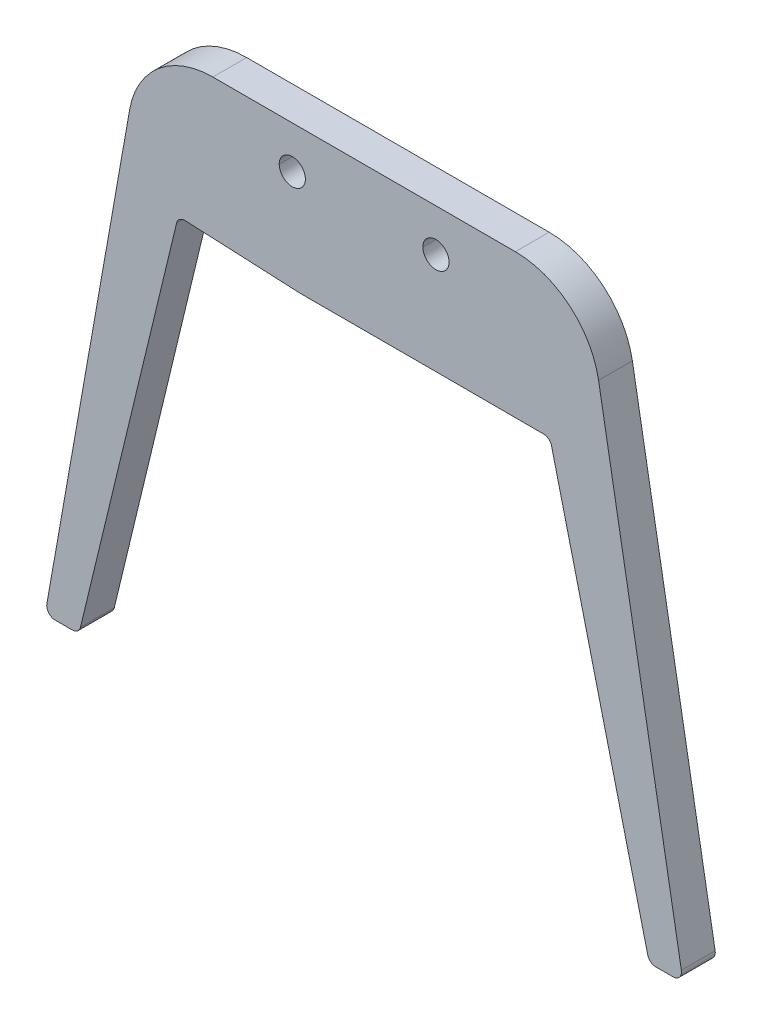
ISO-10303-21;
HEADER;
FILE_DESCRIPTION(('STEP AP214'),'2;1');
FILE_NAME('part.step','',(''),(''),'','','');
FILE_SCHEMA(('AUTOMOTIVE_DESIGN { 1 0 10303 214 1 1 1 1 }'));
ENDSEC;
DATA;
#1=APPLICATION_CONTEXT('core data for automotive mechanical design processes');
#2=APPLICATION_PROTOCOL_DEFINITION('international standard','automotive_design',2000,#1);
#3=PRODUCT_CONTEXT('',#1,'mechanical');
#4=PRODUCT('Part','Part','',(#3));
#5=PRODUCT_RELATED_PRODUCT_CATEGORY('part','',(#4));
#6=PRODUCT_DEFINITION_FORMATION('','',#4);
#7=PRODUCT_DEFINITION_CONTEXT('part definition',#1,'design');
#8=PRODUCT_DEFINITION('design','',#6,#7);
#9=PRODUCT_DEFINITION_SHAPE('','',#8);
#10=(LENGTH_UNIT() NAMED_UNIT(*) SI_UNIT(.MILLI.,.METRE.));
#11=(NAMED_UNIT(*) PLANE_ANGLE_UNIT() SI_UNIT($,.RADIAN.));
#12=(NAMED_UNIT(*) SI_UNIT($,.STERADIAN.) SOLID_ANGLE_UNIT());
#13=UNCERTAINTY_MEASURE_WITH_UNIT(LENGTH_MEASURE(1.E-05),#10,'distance_accuracy_value','');
#14=(GEOMETRIC_REPRESENTATION_CONTEXT(3) GLOBAL_UNCERTAINTY_ASSIGNED_CONTEXT((#13)) GLOBAL_UNIT_ASSIGNED_CONTEXT((#10,
#11,#12)) REPRESENTATION_CONTEXT('',''));
#15=CARTESIAN_POINT('',(0.,0.,0.));
#16=DIRECTION('',(0.,0.,1.));
#17=DIRECTION('',(1.,0.,0.));
#18=AXIS2_PLACEMENT_3D('',#15,#16,#17);
#19=CARTESIAN_POINT('',(-36.5641922306219,-60.,4.));
#20=DIRECTION('',(0.,0.,-1.));
#21=DIRECTION('',(-1.,0.,0.));
#22=AXIS2_PLACEMENT_3D('',#19,#20,#21);
#23=CYLINDRICAL_SURFACE('',#22,1.);
#24=DIRECTION('',(0.,0.,-1.));
#25=VECTOR('',#24,1.);
#26=CARTESIAN_POINT('',(-37.5641922306219,-60.,4.));
#27=LINE('',#26,#25);
#28=CARTESIAN_POINT('',(-37.5641922306219,-60.,4.));
#29=VERTEX_POINT('',#28);
#30=CARTESIAN_POINT('',(-37.5641922306219,-60.,0.));
#31=VERTEX_POINT('',#30);
#32=EDGE_CURVE('E250',#29,#31,#27,.T.);
#33=ORIENTED_EDGE('',*,*,#32,.F.);
#34=CARTESIAN_POINT('',(-36.5641922306219,-60.,4.));
#35=DIRECTION('',(0.,0.,1.));
#36=DIRECTION('',(1.,0.,0.));
#37=AXIS2_PLACEMENT_3D('',#34,#35,#36);
#38=CIRCLE('',#37,1.);
#39=CARTESIAN_POINT('',(-37.5489999836341,-59.8263518223331,4.));
#40=VERTEX_POINT('',#39);
#41=EDGE_CURVE('E233',#40,#29,#38,.T.);
#42=ORIENTED_EDGE('',*,*,#41,.F.);
#43=DIRECTION('',(0.,0.,1.));
#44=VECTOR('',#43,1.);
#45=CARTESIAN_POINT('',(-37.5489999836341,-59.8263518223331,4.));
#46=LINE('',#45,#44);
#47=CARTESIAN_POINT('',(-37.5489999836341,-59.8263518223331,0.));
#48=VERTEX_POINT('',#47);
#49=EDGE_CURVE('E343',#48,#40,#46,.T.);
#50=ORIENTED_EDGE('',*,*,#49,.F.);
#51=CARTESIAN_POINT('',(-36.5641922306219,-60.,0.));
#52=DIRECTION('',(0.,0.,-1.));
#53=DIRECTION('',(1.,0.,0.));
#54=AXIS2_PLACEMENT_3D('',#51,#52,#53);
#55=CIRCLE('',#54,1.);
#56=EDGE_CURVE('E251',#31,#48,#55,.T.);
#57=ORIENTED_EDGE('',*,*,#56,.F.);
#58=EDGE_LOOP('',(#33,#42,#50,#57));
#59=FACE_BOUND('',#58,.T.);
#60=ADVANCED_FACE('F15',(#59),#23,.T.);
#61=CARTESIAN_POINT('',(36.5641922306219,-60.,4.));
#62=DIRECTION('',(0.,0.,-1.));
#63=DIRECTION('',(-1.,0.,0.));
#64=AXIS2_PLACEMENT_3D('',#61,#62,#63);
#65=CYLINDRICAL_SURFACE('',#64,1.);
#66=CARTESIAN_POINT('',(36.5641922306219,-60.,4.));
#67=DIRECTION('',(0.,0.,1.));
#68=DIRECTION('',(1.,0.,0.));
#69=AXIS2_PLACEMENT_3D('',#66,#67,#68);
#70=CIRCLE('',#69,1.);
#71=CARTESIAN_POINT('',(36.5641922306219,-61.,4.));
#72=VERTEX_POINT('',#71);
#73=CARTESIAN_POINT('',(37.5489999836341,-59.8263518223331,4.));
#74=VERTEX_POINT('',#73);
#75=EDGE_CURVE('E311',#72,#74,#70,.T.);
#76=ORIENTED_EDGE('',*,*,#75,.F.);
#77=DIRECTION('',(0.,0.,1.));
#78=VECTOR('',#77,1.);
#79=CARTESIAN_POINT('',(36.5641922306219,-61.,4.));
#80=LINE('',#79,#78);
#81=CARTESIAN_POINT('',(36.5641922306219,-61.,0.));
#82=VERTEX_POINT('',#81);
#83=EDGE_CURVE('E369',#82,#72,#80,.T.);
#84=ORIENTED_EDGE('',*,*,#83,.F.);
#85=CARTESIAN_POINT('',(36.5641922306219,-60.,0.));
#86=DIRECTION('',(0.,0.,-1.));
#87=DIRECTION('',(1.,0.,0.));
#88=AXIS2_PLACEMENT_3D('',#85,#86,#87);
#89=CIRCLE('',#88,1.);
#90=CARTESIAN_POINT('',(37.5489999836341,-59.8263518223331,0.));
#91=VERTEX_POINT('',#90);
#92=EDGE_CURVE('E439',#91,#82,#89,.T.);
#93=ORIENTED_EDGE('',*,*,#92,.F.);
#94=DIRECTION('',(0.,0.,-1.));
#95=VECTOR('',#94,1.);
#96=CARTESIAN_POINT('',(37.5489999836341,-59.8263518223331,4.));
#97=LINE('',#96,#95);
#98=EDGE_CURVE('E380',#74,#91,#97,.T.);
#99=ORIENTED_EDGE('',*,*,#98,.F.);
#100=EDGE_LOOP('',(#76,#84,#93,#99));
#101=FACE_BOUND('',#100,.T.);
#102=ADVANCED_FACE('F1070',(#101),#65,.T.);
#103=CARTESIAN_POINT('',(-34.5432077201924,-60.,4.));
#104=DIRECTION('',(0.,0.,1.));
#105=DIRECTION('',(1.,0.,0.));
#106=AXIS2_PLACEMENT_3D('',#103,#104,#105);
#107=CYLINDRICAL_SURFACE('',#106,1.);
#108=CARTESIAN_POINT('',(-34.5432077201924,-60.,4.));
#109=DIRECTION('',(0.,0.,1.));
#110=DIRECTION('',(1.,0.,0.));
#111=AXIS2_PLACEMENT_3D('',#108,#109,#110);
#112=CIRCLE('',#111,1.);
#113=CARTESIAN_POINT('',(-34.5432077201924,-61.,4.));
#114=VERTEX_POINT('',#113);
#115=CARTESIAN_POINT('',(-33.5711482209462,-60.2347345946497,4.));
#116=VERTEX_POINT('',#115);
#117=EDGE_CURVE('E246',#114,#116,#112,.T.);
#118=ORIENTED_EDGE('',*,*,#117,.F.);
#119=DIRECTION('',(0.,0.,1.));
#120=VECTOR('',#119,1.);
#121=CARTESIAN_POINT('',(-34.5432077201924,-61.,4.));
#122=LINE('',#121,#120);
#123=CARTESIAN_POINT('',(-34.5432077201924,-61.,0.));
#124=VERTEX_POINT('',#123);
#125=EDGE_CURVE('E287',#124,#114,#122,.T.);
#126=ORIENTED_EDGE('',*,*,#125,.F.);
#127=CARTESIAN_POINT('',(-34.5432077201924,-60.,0.));
#128=DIRECTION('',(0.,0.,-1.));
#129=DIRECTION('',(1.,0.,0.));
#130=AXIS2_PLACEMENT_3D('',#127,#128,#129);
#131=CIRCLE('',#130,1.);
#132=CARTESIAN_POINT('',(-33.5711482209462,-60.2347345946497,0.));
#133=VERTEX_POINT('',#132);
#134=EDGE_CURVE('E446',#133,#124,#131,.T.);
#135=ORIENTED_EDGE('',*,*,#134,.F.);
#136=DIRECTION('',(0.,0.,-1.));
#137=VECTOR('',#136,1.);
#138=CARTESIAN_POINT('',(-33.5711482209462,-60.2347345946497,0.));
#139=LINE('',#138,#137);
#140=EDGE_CURVE('E36',#116,#133,#139,.T.);
#141=ORIENTED_EDGE('',*,*,#140,.F.);
#142=EDGE_LOOP('',(#118,#126,#135,#141));
#143=FACE_BOUND('',#142,.T.);
#144=ADVANCED_FACE('F1061',(#143),#107,.T.);
#145=CARTESIAN_POINT('',(34.540515580468,-60.,4.));
#146=DIRECTION('',(0.,0.,1.));
#147=DIRECTION('',(1.,0.,0.));
#148=AXIS2_PLACEMENT_3D('',#145,#146,#147);
#149=CYLINDRICAL_SURFACE('',#148,1.);
#150=CARTESIAN_POINT('',(34.540515580468,-60.,4.));
#151=DIRECTION('',(0.,0.,1.));
#152=DIRECTION('',(1.,0.,0.));
#153=AXIS2_PLACEMENT_3D('',#150,#151,#152);
#154=CIRCLE('',#153,1.);
#155=CARTESIAN_POINT('',(33.5692427619194,-60.2379687205261,4.));
#156=VERTEX_POINT('',#155);
#157=CARTESIAN_POINT('',(34.540515580468,-61.,4.));
#158=VERTEX_POINT('',#157);
#159=EDGE_CURVE('E314',#156,#158,#154,.T.);
#160=ORIENTED_EDGE('',*,*,#159,.F.);
#161=DIRECTION('',(0.,0.,1.));
#162=VECTOR('',#161,1.);
#163=CARTESIAN_POINT('',(33.5692427619194,-60.2379687205261,4.));
#164=LINE('',#163,#162);
#165=CARTESIAN_POINT('',(33.5692427619194,-60.2379687205261,0.));
#166=VERTEX_POINT('',#165);
#167=EDGE_CURVE('E9',#166,#156,#164,.T.);
#168=ORIENTED_EDGE('',*,*,#167,.F.);
#169=CARTESIAN_POINT('',(34.540515580468,-60.,0.));
#170=DIRECTION('',(0.,0.,-1.));
#171=DIRECTION('',(1.,0.,0.));
#172=AXIS2_PLACEMENT_3D('',#169,#170,#171);
#173=CIRCLE('',#172,1.);
#174=CARTESIAN_POINT('',(34.540515580468,-61.,0.));
#175=VERTEX_POINT('',#174);
#176=EDGE_CURVE('E348',#175,#166,#173,.T.);
#177=ORIENTED_EDGE('',*,*,#176,.F.);
#178=DIRECTION('',(0.,0.,-1.));
#179=VECTOR('',#178,1.);
#180=CARTESIAN_POINT('',(34.540515580468,-61.,0.));
#181=LINE('',#180,#179);
#182=EDGE_CURVE('E361',#158,#175,#181,.T.);
#183=ORIENTED_EDGE('',*,*,#182,.F.);
#184=EDGE_LOOP('',(#160,#168,#177,#183));
#185=FACE_BOUND('',#184,.T.);
#186=ADVANCED_FACE('F1053',(#185),#149,.T.);
#187=CARTESIAN_POINT('',(-21.2218508246086,-13.355185972726,4.));
#188=DIRECTION('',(0.,0.,-1.));
#189=DIRECTION('',(-1.,0.,0.));
#190=AXIS2_PLACEMENT_3D('',#187,#188,#189);
#191=CYLINDRICAL_SURFACE('',#190,1.);
#192=CARTESIAN_POINT('',(-21.2218508246086,-13.355185972726,4.));
#193=DIRECTION('',(0.,0.,-1.));
#194=DIRECTION('',(1.,0.,0.));
#195=AXIS2_PLACEMENT_3D('',#192,#193,#194);
#196=CIRCLE('',#195,1.);
#197=CARTESIAN_POINT('',(-22.1939103238548,-13.1204513780763,4.));
#198=VERTEX_POINT('',#197);
#199=CARTESIAN_POINT('',(-21.1748304265378,-12.3562920433395,4.));
#200=VERTEX_POINT('',#199);
#201=EDGE_CURVE('E449',#198,#200,#196,.T.);
#202=ORIENTED_EDGE('',*,*,#201,.F.);
#203=DIRECTION('',(0.,0.,1.));
#204=VECTOR('',#203,1.);
#205=CARTESIAN_POINT('',(-22.1939103238548,-13.1204513780763,4.));
#206=LINE('',#205,#204);
#207=CARTESIAN_POINT('',(-22.1939103238548,-13.1204513780763,0.));
#208=VERTEX_POINT('',#207);
#209=EDGE_CURVE('E47',#208,#198,#206,.T.);
#210=ORIENTED_EDGE('',*,*,#209,.F.);
#211=CARTESIAN_POINT('',(-21.2218508246086,-13.355185972726,0.));
#212=DIRECTION('',(0.,0.,1.));
#213=DIRECTION('',(1.,0.,0.));
#214=AXIS2_PLACEMENT_3D('',#211,#212,#213);
#215=CIRCLE('',#214,1.);
#216=CARTESIAN_POINT('',(-21.1748304265378,-12.3562920433395,0.));
#217=VERTEX_POINT('',#216);
#218=EDGE_CURVE('E479',#217,#208,#215,.T.);
#219=ORIENTED_EDGE('',*,*,#218,.F.);
#220=DIRECTION('',(0.,0.,-1.));
#221=VECTOR('',#220,1.);
#222=CARTESIAN_POINT('',(-21.1748304265378,-12.3562920433395,4.));
#223=LINE('',#222,#221);
#224=EDGE_CURVE('E406',#200,#217,#223,.T.);
#225=ORIENTED_EDGE('',*,*,#224,.F.);
#226=EDGE_LOOP('',(#202,#210,#219,#225));
#227=FACE_BOUND('',#226,.T.);
#228=ADVANCED_FACE('F1044',(#227),#191,.F.);
#229=CARTESIAN_POINT('',(21.2151925965378,-14.0169649671555,4.));
#230=DIRECTION('',(0.,0.,1.));
#231=DIRECTION('',(1.,0.,0.));
#232=AXIS2_PLACEMENT_3D('',#229,#230,#231);
#233=CYLINDRICAL_SURFACE('',#232,1.);
#234=CARTESIAN_POINT('',(21.2151925965378,-14.0169649671555,4.));
#235=DIRECTION('',(0.,0.,-1.));
#236=DIRECTION('',(1.,0.,0.));
#237=AXIS2_PLACEMENT_3D('',#234,#235,#236);
#238=CIRCLE('',#237,1.);
#239=CARTESIAN_POINT('',(21.2164294868774,-13.0169657321047,4.));
#240=VERTEX_POINT('',#239);
#241=CARTESIAN_POINT('',(22.1864654150863,-13.7789962466295,4.));
#242=VERTEX_POINT('',#241);
#243=EDGE_CURVE('E353',#240,#242,#238,.T.);
#244=ORIENTED_EDGE('',*,*,#243,.F.);
#245=DIRECTION('',(0.,0.,1.));
#246=VECTOR('',#245,1.);
#247=CARTESIAN_POINT('',(21.2164294868774,-13.0169657321047,4.));
#248=LINE('',#247,#246);
#249=CARTESIAN_POINT('',(21.2164294868774,-13.0169657321047,0.));
#250=VERTEX_POINT('',#249);
#251=EDGE_CURVE('E403',#250,#240,#248,.T.);
#252=ORIENTED_EDGE('',*,*,#251,.F.);
#253=CARTESIAN_POINT('',(21.2151925965378,-14.0169649671555,0.));
#254=DIRECTION('',(0.,0.,1.));
#255=DIRECTION('',(1.,0.,0.));
#256=AXIS2_PLACEMENT_3D('',#253,#254,#255);
#257=CIRCLE('',#256,1.);
#258=CARTESIAN_POINT('',(22.1864654150863,-13.7789962466295,0.));
#259=VERTEX_POINT('',#258);
#260=EDGE_CURVE('E468',#259,#250,#257,.T.);
#261=ORIENTED_EDGE('',*,*,#260,.F.);
#262=DIRECTION('',(0.,0.,-1.));
#263=VECTOR('',#262,1.);
#264=CARTESIAN_POINT('',(22.1864654150863,-13.7789962466295,0.));
#265=LINE('',#264,#263);
#266=EDGE_CURVE('E18',#242,#259,#265,.T.);
#267=ORIENTED_EDGE('',*,*,#266,.F.);
#268=EDGE_LOOP('',(#244,#252,#261,#267));
#269=FACE_BOUND('',#268,.T.);
#270=ADVANCED_FACE('F1019',(#269),#233,.F.);
#271=CARTESIAN_POINT('',(17.7452910436392,4.34772200392482,4.));
#272=DIRECTION('',(0.97127281854852,0.237968720526066,0.));
#273=DIRECTION('',(0.,0.,-1.));
#274=AXIS2_PLACEMENT_3D('',#271,#272,#273);
#275=PLANE('',#274);
#276=DIRECTION('',(0.237968720526066,-0.971272818548521,0.));
#277=VECTOR('',#276,1.);
#278=CARTESIAN_POINT('',(17.7452910436392,4.34772200392482,4.));
#279=LINE('',#278,#277);
#280=EDGE_CURVE('E434',#242,#156,#279,.T.);
#281=ORIENTED_EDGE('',*,*,#280,.F.);
#282=ORIENTED_EDGE('',*,*,#266,.T.);
#283=DIRECTION('',(0.237968720526066,-0.971272818548521,0.));
#284=VECTOR('',#283,1.);
#285=CARTESIAN_POINT('',(17.7452910436392,4.34772200392482,0.));
#286=LINE('',#285,#284);
#287=EDGE_CURVE('E352',#259,#166,#286,.T.);
#288=ORIENTED_EDGE('',*,*,#287,.T.);
#289=ORIENTED_EDGE('',*,*,#167,.T.);
#290=EDGE_LOOP('',(#281,#282,#288,#289));
#291=FACE_BOUND('',#290,.T.);
#292=ADVANCED_FACE('F1014',(#291),#275,.F.);
#293=CARTESIAN_POINT('',(-0.0160680878825024,-12.9907034408786,4.));
#294=DIRECTION('',(0.00123689033964627,0.999999235050851,0.));
#295=DIRECTION('',(0.,0.,-1.));
#296=AXIS2_PLACEMENT_3D('',#293,#294,#295);
#297=PLANE('',#296);
#298=DIRECTION('',(0.999999235050851,-0.00123689033964627,0.));
#299=VECTOR('',#298,1.);
#300=CARTESIAN_POINT('',(-0.0160680878825024,-12.9907034408786,0.));
#301=LINE('',#300,#299);
#302=CARTESIAN_POINT('',(7.5,-13.,0.));
#303=VERTEX_POINT('',#302);
#304=EDGE_CURVE('E472',#303,#250,#301,.T.);
#305=ORIENTED_EDGE('',*,*,#304,.T.);
#306=ORIENTED_EDGE('',*,*,#251,.T.);
#307=DIRECTION('',(0.999999235050851,-0.00123689033964627,0.));
#308=VECTOR('',#307,1.);
#309=CARTESIAN_POINT('',(-0.0160680878825024,-12.9907034408786,4.));
#310=LINE('',#309,#308);
#311=CARTESIAN_POINT('',(7.5,-13.,4.));
#312=VERTEX_POINT('',#311);
#313=EDGE_CURVE('E456',#312,#240,#310,.T.);
#314=ORIENTED_EDGE('',*,*,#313,.F.);
#315=DIRECTION('',(0.,0.,-1.));
#316=VECTOR('',#315,1.);
#317=CARTESIAN_POINT('',(7.5,-13.,4.));
#318=LINE('',#317,#316);
#319=EDGE_CURVE('E340',#312,#303,#318,.T.);
#320=ORIENTED_EDGE('',*,*,#319,.T.);
#321=EDGE_LOOP('',(#305,#306,#314,#320));
#322=FACE_BOUND('',#321,.T.);
#323=ADVANCED_FACE('F1018',(#322),#297,.F.);
#324=CARTESIAN_POINT('',(-0.627170956233433,-13.3235209945752,4.));
#325=DIRECTION('',(0.0470203980707653,0.998893929386532,0.));
#326=DIRECTION('',(0.,0.,-1.));
#327=AXIS2_PLACEMENT_3D('',#324,#325,#326);
#328=PLANE('',#327);
#329=DIRECTION('',(0.998893929386533,-0.0470203980707653,0.));
#330=VECTOR('',#329,1.);
#331=CARTESIAN_POINT('',(-0.627170956233433,-13.3235209945752,4.));
#332=LINE('',#331,#330);
#333=CARTESIAN_POINT('',(-8.29846263323383,-12.9624143968095,4.));
#334=VERTEX_POINT('',#333);
#335=EDGE_CURVE('E453',#200,#334,#332,.T.);
#336=ORIENTED_EDGE('',*,*,#335,.F.);
#337=ORIENTED_EDGE('',*,*,#224,.T.);
#338=DIRECTION('',(0.998893929386533,-0.0470203980707653,0.));
#339=VECTOR('',#338,1.);
#340=CARTESIAN_POINT('',(-0.627170956233433,-13.3235209945752,0.));
#341=LINE('',#340,#339);
#342=CARTESIAN_POINT('',(-8.29846263323383,-12.9624143968095,0.));
#343=VERTEX_POINT('',#342);
#344=EDGE_CURVE('E476',#217,#343,#341,.T.);
#345=ORIENTED_EDGE('',*,*,#344,.T.);
#346=DIRECTION('',(0.,0.,-1.));
#347=VECTOR('',#346,1.);
#348=CARTESIAN_POINT('',(-8.29846263323387,-12.9624143968095,4.));
#349=LINE('',#348,#347);
#350=EDGE_CURVE('E310',#334,#343,#349,.T.);
#351=ORIENTED_EDGE('',*,*,#350,.F.);
#352=EDGE_LOOP('',(#336,#337,#345,#351));
#353=FACE_BOUND('',#352,.T.);
#354=ADVANCED_FACE('F1009',(#353),#328,.F.);
#355=CARTESIAN_POINT('',(-17.9772465270313,4.34117631658567,4.));
#356=DIRECTION('',(0.972059499246145,-0.234734594649648,0.));
#357=DIRECTION('',(0.,0.,-1.));
#358=AXIS2_PLACEMENT_3D('',#355,#356,#357);
#359=PLANE('',#358);
#360=DIRECTION('',(-0.234734594649648,-0.972059499246145,0.));
#361=VECTOR('',#360,1.);
#362=CARTESIAN_POINT('',(-17.9772465270313,4.34117631658567,0.));
#363=LINE('',#362,#361);
#364=EDGE_CURVE('E483',#208,#133,#363,.T.);
#365=ORIENTED_EDGE('',*,*,#364,.F.);
#366=ORIENTED_EDGE('',*,*,#209,.T.);
#367=DIRECTION('',(-0.234734594649648,-0.972059499246145,0.));
#368=VECTOR('',#367,1.);
#369=CARTESIAN_POINT('',(-17.9772465270313,4.34117631658567,4.));
#370=LINE('',#369,#368);
#371=EDGE_CURVE('E377',#198,#116,#370,.T.);
#372=ORIENTED_EDGE('',*,*,#371,.T.);
#373=ORIENTED_EDGE('',*,*,#140,.T.);
#374=EDGE_LOOP('',(#365,#366,#372,#373));
#375=FACE_BOUND('',#374,.T.);
#376=ADVANCED_FACE('F1000',(#375),#359,.T.);
#377=CARTESIAN_POINT('',(-17.9036957653934,-6.,4.));
#378=DIRECTION('',(0.,0.,1.));
#379=DIRECTION('',(1.,0.,0.));
#380=AXIS2_PLACEMENT_3D('',#377,#378,#379);
#381=CYLINDRICAL_SURFACE('',#380,10.);
#382=CARTESIAN_POINT('',(-17.9036957653934,-6.,4.));
#383=DIRECTION('',(0.,0.,1.));
#384=DIRECTION('',(1.,0.,0.));
#385=AXIS2_PLACEMENT_3D('',#382,#383,#384);
#386=CIRCLE('',#385,10.);
#387=CARTESIAN_POINT('',(-17.9036957653934,3.99999999999996,4.));
#388=VERTEX_POINT('',#387);
#389=CARTESIAN_POINT('',(-27.7517732955154,-4.26351822333078,4.));
#390=VERTEX_POINT('',#389);
#391=EDGE_CURVE('E247',#388,#390,#386,.T.);
#392=ORIENTED_EDGE('',*,*,#391,.F.);
#393=DIRECTION('',(0.,0.,1.));
#394=VECTOR('',#393,1.);
#395=CARTESIAN_POINT('',(-17.9036957653934,3.99999999999996,4.));
#396=LINE('',#395,#394);
#397=CARTESIAN_POINT('',(-17.9036957653934,3.99999999999996,0.));
#398=VERTEX_POINT('',#397);
#399=EDGE_CURVE('E410',#398,#388,#396,.T.);
#400=ORIENTED_EDGE('',*,*,#399,.F.);
#401=CARTESIAN_POINT('',(-17.9036957653934,-6.,0.));
#402=DIRECTION('',(0.,0.,-1.));
#403=DIRECTION('',(1.,0.,0.));
#404=AXIS2_PLACEMENT_3D('',#401,#402,#403);
#405=CIRCLE('',#404,10.);
#406=CARTESIAN_POINT('',(-27.7517732955154,-4.26351822333078,0.));
#407=VERTEX_POINT('',#406);
#408=EDGE_CURVE('E445',#407,#398,#405,.T.);
#409=ORIENTED_EDGE('',*,*,#408,.F.);
#410=DIRECTION('',(0.,0.,-1.));
#411=VECTOR('',#410,1.);
#412=CARTESIAN_POINT('',(-27.7517732955154,-4.26351822333078,0.));
#413=LINE('',#412,#411);
#414=EDGE_CURVE('E288',#390,#407,#413,.T.);
#415=ORIENTED_EDGE('',*,*,#414,.F.);
#416=EDGE_LOOP('',(#392,#400,#409,#415));
#417=FACE_BOUND('',#416,.T.);
#418=ADVANCED_FACE('F991',(#417),#381,.T.);
#419=CARTESIAN_POINT('',(17.9036957653934,-6.,4.));
#420=DIRECTION('',(0.,0.,-1.));
#421=DIRECTION('',(-1.,0.,0.));
#422=AXIS2_PLACEMENT_3D('',#419,#420,#421);
#423=CYLINDRICAL_SURFACE('',#422,10.);
#424=CARTESIAN_POINT('',(17.9036957653934,-6.,4.));
#425=DIRECTION('',(0.,0.,1.));
#426=DIRECTION('',(1.,0.,0.));
#427=AXIS2_PLACEMENT_3D('',#424,#425,#426);
#428=CIRCLE('',#427,10.);
#429=CARTESIAN_POINT('',(27.7517732955154,-4.26351822333075,4.));
#430=VERTEX_POINT('',#429);
#431=CARTESIAN_POINT('',(17.9036957653933,4.,4.));
#432=VERTEX_POINT('',#431);
#433=EDGE_CURVE('E270',#430,#432,#428,.T.);
#434=ORIENTED_EDGE('',*,*,#433,.F.);
#435=DIRECTION('',(0.,0.,1.));
#436=VECTOR('',#435,1.);
#437=CARTESIAN_POINT('',(27.7517732955154,-4.26351822333074,4.));
#438=LINE('',#437,#436);
#439=CARTESIAN_POINT('',(27.7517732955154,-4.26351822333075,0.));
#440=VERTEX_POINT('',#439);
#441=EDGE_CURVE('E390',#440,#430,#438,.T.);
#442=ORIENTED_EDGE('',*,*,#441,.F.);
#443=CARTESIAN_POINT('',(17.9036957653934,-6.,0.));
#444=DIRECTION('',(0.,0.,-1.));
#445=DIRECTION('',(1.,0.,0.));
#446=AXIS2_PLACEMENT_3D('',#443,#444,#445);
#447=CIRCLE('',#446,10.);
#448=CARTESIAN_POINT('',(17.9036957653933,4.,0.));
#449=VERTEX_POINT('',#448);
#450=EDGE_CURVE('E442',#449,#440,#447,.T.);
#451=ORIENTED_EDGE('',*,*,#450,.F.);
#452=DIRECTION('',(0.,0.,-1.));
#453=VECTOR('',#452,1.);
#454=CARTESIAN_POINT('',(17.9036957653933,4.,4.));
#455=LINE('',#454,#453);
#456=EDGE_CURVE('E398',#432,#449,#455,.T.);
#457=ORIENTED_EDGE('',*,*,#456,.F.);
#458=EDGE_LOOP('',(#434,#442,#451,#457));
#459=FACE_BOUND('',#458,.T.);
#460=ADVANCED_FACE('F982',(#459),#423,.T.);
#461=CARTESIAN_POINT('',(0.,0.,0.));
#462=DIRECTION('',(0.,0.,1.));
#463=DIRECTION('',(1.,0.,0.));
#464=AXIS2_PLACEMENT_3D('',#461,#462,#463);
#465=PLANE('',#464);
#466=CARTESIAN_POINT('',(8.5,-1.,0.));
#467=DIRECTION('',(0.,0.,1.));
#468=DIRECTION('',(1.,0.,0.));
#469=AXIS2_PLACEMENT_3D('',#466,#467,#468);
#470=CIRCLE('',#469,1.55);
#471=CARTESIAN_POINT('',(6.95,-1.,0.));
#472=VERTEX_POINT('',#471);
#473=CARTESIAN_POINT('',(10.05,-1.,0.));
#474=VERTEX_POINT('',#473);
#475=EDGE_CURVE('E299',#472,#474,#470,.T.);
#476=ORIENTED_EDGE('',*,*,#475,.T.);
#477=CARTESIAN_POINT('',(8.5,-1.,0.));
#478=DIRECTION('',(0.,0.,1.));
#479=DIRECTION('',(1.,0.,0.));
#480=AXIS2_PLACEMENT_3D('',#477,#478,#479);
#481=CIRCLE('',#480,1.55);
#482=EDGE_CURVE('E431',#474,#472,#481,.T.);
#483=ORIENTED_EDGE('',*,*,#482,.T.);
#484=EDGE_LOOP('',(#476,#483));
#485=FACE_BOUND('',#484,.T.);
#486=CARTESIAN_POINT('',(-8.5,-1.,0.));
#487=DIRECTION('',(0.,0.,1.));
#488=DIRECTION('',(1.,0.,0.));
#489=AXIS2_PLACEMENT_3D('',#486,#487,#488);
#490=CIRCLE('',#489,1.55);
#491=CARTESIAN_POINT('',(-10.05,-1.,0.));
#492=VERTEX_POINT('',#491);
#493=CARTESIAN_POINT('',(-6.95,-1.,0.));
#494=VERTEX_POINT('',#493);
#495=EDGE_CURVE('E271',#492,#494,#490,.T.);
#496=ORIENTED_EDGE('',*,*,#495,.T.);
#497=CARTESIAN_POINT('',(-8.5,-1.,0.));
#498=DIRECTION('',(0.,0.,1.));
#499=DIRECTION('',(1.,0.,0.));
#500=AXIS2_PLACEMENT_3D('',#497,#498,#499);
#501=CIRCLE('',#500,1.55);
#502=EDGE_CURVE('E425',#494,#492,#501,.T.);
#503=ORIENTED_EDGE('',*,*,#502,.T.);
#504=EDGE_LOOP('',(#496,#503));
#505=FACE_BOUND('',#504,.T.);
#506=DIRECTION('',(-1.,0.,0.));
#507=VECTOR('',#506,1.);
#508=CARTESIAN_POINT('',(0.,-61.,0.));
#509=LINE('',#508,#507);
#510=EDGE_CURVE('E365',#82,#175,#509,.T.);
#511=ORIENTED_EDGE('',*,*,#510,.T.);
#512=ORIENTED_EDGE('',*,*,#176,.T.);
#513=ORIENTED_EDGE('',*,*,#287,.F.);
#514=ORIENTED_EDGE('',*,*,#260,.T.);
#515=ORIENTED_EDGE('',*,*,#304,.F.);
#516=DIRECTION('',(1.,0.,0.));
#517=VECTOR('',#516,1.);
#518=CARTESIAN_POINT('',(0.,-13.,0.));
#519=LINE('',#518,#517);
#520=CARTESIAN_POINT('',(-7.5,-13.,0.));
#521=VERTEX_POINT('',#520);
#522=EDGE_CURVE('E336',#521,#303,#519,.T.);
#523=ORIENTED_EDGE('',*,*,#522,.F.);
#524=CARTESIAN_POINT('',(-7.5,-4.5,0.));
#525=DIRECTION('',(0.,0.,-1.));
#526=DIRECTION('',(1.,0.,0.));
#527=AXIS2_PLACEMENT_3D('',#524,#525,#526);
#528=CIRCLE('',#527,8.5);
#529=EDGE_CURVE('E321',#521,#343,#528,.T.);
#530=ORIENTED_EDGE('',*,*,#529,.T.);
#531=ORIENTED_EDGE('',*,*,#344,.F.);
#532=ORIENTED_EDGE('',*,*,#218,.T.);
#533=ORIENTED_EDGE('',*,*,#364,.T.);
#534=ORIENTED_EDGE('',*,*,#134,.T.);
#535=DIRECTION('',(1.,0.,0.));
#536=VECTOR('',#535,1.);
#537=CARTESIAN_POINT('',(0.,-61.,0.));
#538=LINE('',#537,#536);
#539=CARTESIAN_POINT('',(-36.5641922306219,-61.,0.));
#540=VERTEX_POINT('',#539);
#541=EDGE_CURVE('E283',#540,#124,#538,.T.);
#542=ORIENTED_EDGE('',*,*,#541,.F.);
#543=CARTESIAN_POINT('',(-36.5641922306219,-60.,0.));
#544=DIRECTION('',(0.,0.,-1.));
#545=DIRECTION('',(1.,0.,0.));
#546=AXIS2_PLACEMENT_3D('',#543,#544,#545);
#547=CIRCLE('',#546,1.);
#548=EDGE_CURVE('E256',#540,#31,#547,.T.);
#549=ORIENTED_EDGE('',*,*,#548,.T.);
#550=ORIENTED_EDGE('',*,*,#56,.T.);
#551=DIRECTION('',(-0.173648177666927,-0.984807753012209,0.));
#552=VECTOR('',#551,1.);
#553=CARTESIAN_POINT('',(-26.1858503806098,4.61727193489643,0.));
#554=LINE('',#553,#552);
#555=EDGE_CURVE('E414',#407,#48,#554,.T.);
#556=ORIENTED_EDGE('',*,*,#555,.F.);
#557=ORIENTED_EDGE('',*,*,#408,.T.);
#558=DIRECTION('',(1.,0.,0.));
#559=VECTOR('',#558,1.);
#560=CARTESIAN_POINT('',(0.,4.,0.));
#561=LINE('',#560,#559);
#562=EDGE_CURVE('E402',#398,#449,#561,.T.);
#563=ORIENTED_EDGE('',*,*,#562,.T.);
#564=ORIENTED_EDGE('',*,*,#450,.T.);
#565=DIRECTION('',(0.173648177666927,-0.984807753012209,0.));
#566=VECTOR('',#565,1.);
#567=CARTESIAN_POINT('',(26.1858503806098,4.61727193489643,0.));
#568=LINE('',#567,#566);
#569=EDGE_CURVE('E386',#440,#91,#568,.T.);
#570=ORIENTED_EDGE('',*,*,#569,.T.);
#571=ORIENTED_EDGE('',*,*,#92,.T.);
#572=EDGE_LOOP('',(#511,#512,#513,#514,#515,#523,#530,#531,#532,#533,#534,#542,#549,#550,#556,
#557,#563,#564,#570,#571));
#573=FACE_BOUND('',#572,.T.);
#574=ADVANCED_FACE('F905',(#485,#505,#573),#465,.F.);
#575=CARTESIAN_POINT('',(0.,0.,4.));
#576=DIRECTION('',(0.,0.,1.));
#577=DIRECTION('',(1.,0.,0.));
#578=AXIS2_PLACEMENT_3D('',#575,#576,#577);
#579=PLANE('',#578);
#580=CARTESIAN_POINT('',(8.5,-1.,4.));
#581=DIRECTION('',(0.,0.,1.));
#582=DIRECTION('',(1.,0.,0.));
#583=AXIS2_PLACEMENT_3D('',#580,#581,#582);
#584=CIRCLE('',#583,1.55);
#585=CARTESIAN_POINT('',(6.95,-1.,4.));
#586=VERTEX_POINT('',#585);
#587=CARTESIAN_POINT('',(10.05,-1.,4.));
#588=VERTEX_POINT('',#587);
#589=EDGE_CURVE('E291',#586,#588,#584,.T.);
#590=ORIENTED_EDGE('',*,*,#589,.F.);
#591=CARTESIAN_POINT('',(8.5,-1.,4.));
#592=DIRECTION('',(0.,0.,1.));
#593=DIRECTION('',(1.,0.,0.));
#594=AXIS2_PLACEMENT_3D('',#591,#592,#593);
#595=CIRCLE('',#594,1.55);
#596=EDGE_CURVE('E428',#588,#586,#595,.T.);
#597=ORIENTED_EDGE('',*,*,#596,.F.);
#598=EDGE_LOOP('',(#590,#597));
#599=FACE_BOUND('',#598,.T.);
#600=CARTESIAN_POINT('',(-8.5,-1.,4.));
#601=DIRECTION('',(0.,0.,1.));
#602=DIRECTION('',(1.,0.,0.));
#603=AXIS2_PLACEMENT_3D('',#600,#601,#602);
#604=CIRCLE('',#603,1.55);
#605=CARTESIAN_POINT('',(-10.05,-1.,4.));
#606=VERTEX_POINT('',#605);
#607=CARTESIAN_POINT('',(-6.95,-1.,4.));
#608=VERTEX_POINT('',#607);
#609=EDGE_CURVE('E300',#606,#608,#604,.T.);
#610=ORIENTED_EDGE('',*,*,#609,.F.);
#611=CARTESIAN_POINT('',(-8.5,-1.,4.));
#612=DIRECTION('',(0.,0.,1.));
#613=DIRECTION('',(1.,0.,0.));
#614=AXIS2_PLACEMENT_3D('',#611,#612,#613);
#615=CIRCLE('',#614,1.55);
#616=EDGE_CURVE('E422',#608,#606,#615,.T.);
#617=ORIENTED_EDGE('',*,*,#616,.F.);
#618=EDGE_LOOP('',(#610,#617));
#619=FACE_BOUND('',#618,.T.);
#620=ORIENTED_EDGE('',*,*,#280,.T.);
#621=ORIENTED_EDGE('',*,*,#159,.T.);
#622=DIRECTION('',(-1.,0.,0.));
#623=VECTOR('',#622,1.);
#624=CARTESIAN_POINT('',(0.,-61.,4.));
#625=LINE('',#624,#623);
#626=EDGE_CURVE('E357',#72,#158,#625,.T.);
#627=ORIENTED_EDGE('',*,*,#626,.F.);
#628=ORIENTED_EDGE('',*,*,#75,.T.);
#629=DIRECTION('',(0.173648177666927,-0.984807753012209,0.));
#630=VECTOR('',#629,1.);
#631=CARTESIAN_POINT('',(26.1858503806098,4.61727193489643,4.));
#632=LINE('',#631,#630);
#633=EDGE_CURVE('E373',#430,#74,#632,.T.);
#634=ORIENTED_EDGE('',*,*,#633,.F.);
#635=ORIENTED_EDGE('',*,*,#433,.T.);
#636=DIRECTION('',(1.,0.,0.));
#637=VECTOR('',#636,1.);
#638=CARTESIAN_POINT('',(0.,4.,4.));
#639=LINE('',#638,#637);
#640=EDGE_CURVE('E394',#388,#432,#639,.T.);
#641=ORIENTED_EDGE('',*,*,#640,.F.);
#642=ORIENTED_EDGE('',*,*,#391,.T.);
#643=DIRECTION('',(-0.173648177666927,-0.984807753012209,0.));
#644=VECTOR('',#643,1.);
#645=CARTESIAN_POINT('',(-26.1858503806098,4.61727193489643,4.));
#646=LINE('',#645,#644);
#647=EDGE_CURVE('E241',#390,#40,#646,.T.);
#648=ORIENTED_EDGE('',*,*,#647,.T.);
#649=ORIENTED_EDGE('',*,*,#41,.T.);
#650=CARTESIAN_POINT('',(-36.5641922306219,-60.,4.));
#651=DIRECTION('',(0.,0.,1.));
#652=DIRECTION('',(1.,0.,0.));
#653=AXIS2_PLACEMENT_3D('',#650,#651,#652);
#654=CIRCLE('',#653,1.);
#655=CARTESIAN_POINT('',(-36.5641922306219,-61.,4.));
#656=VERTEX_POINT('',#655);
#657=EDGE_CURVE('E239',#29,#656,#654,.T.);
#658=ORIENTED_EDGE('',*,*,#657,.T.);
#659=DIRECTION('',(1.,0.,0.));
#660=VECTOR('',#659,1.);
#661=CARTESIAN_POINT('',(0.,-61.,4.));
#662=LINE('',#661,#660);
#663=EDGE_CURVE('E328',#656,#114,#662,.T.);
#664=ORIENTED_EDGE('',*,*,#663,.T.);
#665=ORIENTED_EDGE('',*,*,#117,.T.);
#666=ORIENTED_EDGE('',*,*,#371,.F.);
#667=ORIENTED_EDGE('',*,*,#201,.T.);
#668=ORIENTED_EDGE('',*,*,#335,.T.);
#669=CARTESIAN_POINT('',(-7.5,-4.5,4.));
#670=DIRECTION('',(0.,0.,-1.));
#671=DIRECTION('',(1.,0.,0.));
#672=AXIS2_PLACEMENT_3D('',#669,#670,#671);
#673=CIRCLE('',#672,8.5);
#674=CARTESIAN_POINT('',(-7.5,-13.,4.));
#675=VERTEX_POINT('',#674);
#676=EDGE_CURVE('E282',#675,#334,#673,.T.);
#677=ORIENTED_EDGE('',*,*,#676,.F.);
#678=DIRECTION('',(1.,0.,0.));
#679=VECTOR('',#678,1.);
#680=CARTESIAN_POINT('',(0.,-13.,4.));
#681=LINE('',#680,#679);
#682=EDGE_CURVE('E347',#675,#312,#681,.T.);
#683=ORIENTED_EDGE('',*,*,#682,.T.);
#684=ORIENTED_EDGE('',*,*,#313,.T.);
#685=ORIENTED_EDGE('',*,*,#243,.T.);
#686=EDGE_LOOP('',(#620,#621,#627,#628,#634,#635,#641,#642,#648,#649,#658,#664,#665,#666,#667,
#668,#677,#683,#684,#685));
#687=FACE_BOUND('',#686,.T.);
#688=ADVANCED_FACE('F236',(#599,#619,#687),#579,.T.);
#689=CARTESIAN_POINT('',(8.5,-1.,4.));
#690=DIRECTION('',(0.,0.,-1.));
#691=DIRECTION('',(-1.,0.,0.));
#692=AXIS2_PLACEMENT_3D('',#689,#690,#691);
#693=CYLINDRICAL_SURFACE('',#692,1.55);
#694=DIRECTION('',(0.,0.,-1.));
#695=VECTOR('',#694,1.);
#696=CARTESIAN_POINT('',(10.05,-1.,4.));
#697=LINE('',#696,#695);
#698=EDGE_CURVE('E295',#588,#474,#697,.T.);
#699=ORIENTED_EDGE('',*,*,#698,.F.);
#700=ORIENTED_EDGE('',*,*,#596,.T.);
#701=DIRECTION('',(0.,0.,-1.));
#702=VECTOR('',#701,1.);
#703=CARTESIAN_POINT('',(6.95,-1.,4.));
#704=LINE('',#703,#702);
#705=EDGE_CURVE('E304',#586,#472,#704,.T.);
#706=ORIENTED_EDGE('',*,*,#705,.T.);
#707=ORIENTED_EDGE('',*,*,#482,.F.);
#708=EDGE_LOOP('',(#699,#700,#706,#707));
#709=FACE_BOUND('',#708,.T.);
#710=ADVANCED_FACE('F904',(#709),#693,.F.);
#711=CARTESIAN_POINT('',(-8.5,-1.,4.));
#712=DIRECTION('',(0.,0.,-1.));
#713=DIRECTION('',(-1.,0.,0.));
#714=AXIS2_PLACEMENT_3D('',#711,#712,#713);
#715=CYLINDRICAL_SURFACE('',#714,1.55);
#716=DIRECTION('',(0.,0.,-1.));
#717=VECTOR('',#716,1.);
#718=CARTESIAN_POINT('',(-6.95,-1.,4.));
#719=LINE('',#718,#717);
#720=EDGE_CURVE('E276',#608,#494,#719,.T.);
#721=ORIENTED_EDGE('',*,*,#720,.F.);
#722=ORIENTED_EDGE('',*,*,#616,.T.);
#723=DIRECTION('',(0.,0.,-1.));
#724=VECTOR('',#723,1.);
#725=CARTESIAN_POINT('',(-10.05,-1.,4.));
#726=LINE('',#725,#724);
#727=EDGE_CURVE('E275',#606,#492,#726,.T.);
#728=ORIENTED_EDGE('',*,*,#727,.T.);
#729=ORIENTED_EDGE('',*,*,#502,.F.);
#730=EDGE_LOOP('',(#721,#722,#728,#729));
#731=FACE_BOUND('',#730,.T.);
#732=ADVANCED_FACE('F957',(#731),#715,.F.);
#733=CARTESIAN_POINT('',(0.,-61.,4.));
#734=DIRECTION('',(0.,1.,0.));
#735=DIRECTION('',(1.,0.,0.));
#736=AXIS2_PLACEMENT_3D('',#733,#734,#735);
#737=PLANE('',#736);
#738=ORIENTED_EDGE('',*,*,#541,.T.);
#739=ORIENTED_EDGE('',*,*,#125,.T.);
#740=ORIENTED_EDGE('',*,*,#663,.F.);
#741=DIRECTION('',(0.,0.,-1.));
#742=VECTOR('',#741,1.);
#743=CARTESIAN_POINT('',(-36.5641922306219,-61.,4.));
#744=LINE('',#743,#742);
#745=EDGE_CURVE('E261',#656,#540,#744,.T.);
#746=ORIENTED_EDGE('',*,*,#745,.T.);
#747=EDGE_LOOP('',(#738,#739,#740,#746));
#748=FACE_BOUND('',#747,.T.);
#749=ADVANCED_FACE('F886',(#748),#737,.F.);
#750=CARTESIAN_POINT('',(-26.1858503806098,4.61727193489643,4.));
#751=DIRECTION('',(0.984807753012209,-0.173648177666927,0.));
#752=DIRECTION('',(0.,0.,-1.));
#753=AXIS2_PLACEMENT_3D('',#750,#751,#752);
#754=PLANE('',#753);
#755=ORIENTED_EDGE('',*,*,#555,.T.);
#756=ORIENTED_EDGE('',*,*,#49,.T.);
#757=ORIENTED_EDGE('',*,*,#647,.F.);
#758=ORIENTED_EDGE('',*,*,#414,.T.);
#759=EDGE_LOOP('',(#755,#756,#757,#758));
#760=FACE_BOUND('',#759,.T.);
#761=ADVANCED_FACE('F881',(#760),#754,.F.);
#762=CARTESIAN_POINT('',(0.,4.,4.));
#763=DIRECTION('',(0.,1.,0.));
#764=DIRECTION('',(1.,0.,0.));
#765=AXIS2_PLACEMENT_3D('',#762,#763,#764);
#766=PLANE('',#765);
#767=ORIENTED_EDGE('',*,*,#640,.T.);
#768=ORIENTED_EDGE('',*,*,#456,.T.);
#769=ORIENTED_EDGE('',*,*,#562,.F.);
#770=ORIENTED_EDGE('',*,*,#399,.T.);
#771=EDGE_LOOP('',(#767,#768,#769,#770));
#772=FACE_BOUND('',#771,.T.);
#773=ADVANCED_FACE('F885',(#772),#766,.T.);
#774=CARTESIAN_POINT('',(26.1858503806098,4.61727193489643,4.));
#775=DIRECTION('',(0.984807753012209,0.173648177666927,0.));
#776=DIRECTION('',(0.,0.,-1.));
#777=AXIS2_PLACEMENT_3D('',#774,#775,#776);
#778=PLANE('',#777);
#779=ORIENTED_EDGE('',*,*,#633,.T.);
#780=ORIENTED_EDGE('',*,*,#98,.T.);
#781=ORIENTED_EDGE('',*,*,#569,.F.);
#782=ORIENTED_EDGE('',*,*,#441,.T.);
#783=EDGE_LOOP('',(#779,#780,#781,#782));
#784=FACE_BOUND('',#783,.T.);
#785=ADVANCED_FACE('F914',(#784),#778,.T.);
#786=CARTESIAN_POINT('',(0.,-61.,4.));
#787=DIRECTION('',(0.,-1.,0.));
#788=DIRECTION('',(0.,0.,-1.));
#789=AXIS2_PLACEMENT_3D('',#786,#787,#788);
#790=PLANE('',#789);
#791=ORIENTED_EDGE('',*,*,#626,.T.);
#792=ORIENTED_EDGE('',*,*,#182,.T.);
#793=ORIENTED_EDGE('',*,*,#510,.F.);
#794=ORIENTED_EDGE('',*,*,#83,.T.);
#795=EDGE_LOOP('',(#791,#792,#793,#794));
#796=FACE_BOUND('',#795,.T.);
#797=ADVANCED_FACE('F932',(#796),#790,.T.);
#798=CARTESIAN_POINT('',(0.,-13.,4.));
#799=DIRECTION('',(0.,1.,0.));
#800=DIRECTION('',(1.,0.,0.));
#801=AXIS2_PLACEMENT_3D('',#798,#799,#800);
#802=PLANE('',#801);
#803=ORIENTED_EDGE('',*,*,#522,.T.);
#804=ORIENTED_EDGE('',*,*,#319,.F.);
#805=ORIENTED_EDGE('',*,*,#682,.F.);
#806=DIRECTION('',(0.,0.,-1.));
#807=VECTOR('',#806,1.);
#808=CARTESIAN_POINT('',(-7.5,-13.,4.));
#809=LINE('',#808,#807);
#810=EDGE_CURVE('E332',#675,#521,#809,.T.);
#811=ORIENTED_EDGE('',*,*,#810,.T.);
#812=EDGE_LOOP('',(#803,#804,#805,#811));
#813=FACE_BOUND('',#812,.T.);
#814=ADVANCED_FACE('F923',(#813),#802,.F.);
#815=CARTESIAN_POINT('',(-7.5,-4.5,4.));
#816=DIRECTION('',(0.,0.,-1.));
#817=DIRECTION('',(-1.,0.,0.));
#818=AXIS2_PLACEMENT_3D('',#815,#816,#817);
#819=CYLINDRICAL_SURFACE('',#818,8.5);
#820=ORIENTED_EDGE('',*,*,#676,.T.);
#821=ORIENTED_EDGE('',*,*,#350,.T.);
#822=ORIENTED_EDGE('',*,*,#529,.F.);
#823=ORIENTED_EDGE('',*,*,#810,.F.);
#824=EDGE_LOOP('',(#820,#821,#822,#823));
#825=FACE_BOUND('',#824,.T.);
#826=ADVANCED_FACE('F895',(#825),#819,.T.);
#827=CARTESIAN_POINT('',(-8.5,-1.,4.));
#828=DIRECTION('',(0.,0.,-1.));
#829=DIRECTION('',(-1.,0.,0.));
#830=AXIS2_PLACEMENT_3D('',#827,#828,#829);
#831=CYLINDRICAL_SURFACE('',#830,1.55);
#832=ORIENTED_EDGE('',*,*,#609,.T.);
#833=ORIENTED_EDGE('',*,*,#720,.T.);
#834=ORIENTED_EDGE('',*,*,#495,.F.);
#835=ORIENTED_EDGE('',*,*,#727,.F.);
#836=EDGE_LOOP('',(#832,#833,#834,#835));
#837=FACE_BOUND('',#836,.T.);
#838=ADVANCED_FACE('F875',(#837),#831,.F.);
#839=CARTESIAN_POINT('',(8.5,-1.,4.));
#840=DIRECTION('',(0.,0.,-1.));
#841=DIRECTION('',(-1.,0.,0.));
#842=AXIS2_PLACEMENT_3D('',#839,#840,#841);
#843=CYLINDRICAL_SURFACE('',#842,1.55);
#844=ORIENTED_EDGE('',*,*,#589,.T.);
#845=ORIENTED_EDGE('',*,*,#698,.T.);
#846=ORIENTED_EDGE('',*,*,#475,.F.);
#847=ORIENTED_EDGE('',*,*,#705,.F.);
#848=EDGE_LOOP('',(#844,#845,#846,#847));
#849=FACE_BOUND('',#848,.T.);
#850=ADVANCED_FACE('F867',(#849),#843,.F.);
#851=CARTESIAN_POINT('',(-36.5641922306219,-60.,4.));
#852=DIRECTION('',(0.,0.,-1.));
#853=DIRECTION('',(-1.,0.,0.));
#854=AXIS2_PLACEMENT_3D('',#851,#852,#853);
#855=CYLINDRICAL_SURFACE('',#854,1.);
#856=ORIENTED_EDGE('',*,*,#657,.F.);
#857=ORIENTED_EDGE('',*,*,#32,.T.);
#858=ORIENTED_EDGE('',*,*,#548,.F.);
#859=ORIENTED_EDGE('',*,*,#745,.F.);
#860=EDGE_LOOP('',(#856,#857,#858,#859));
#861=FACE_BOUND('',#860,.T.);
#862=ADVANCED_FACE('F259',(#861),#855,.T.);
#863=CLOSED_SHELL('',(#60,#102,#144,#186,#228,#270,#292,#323,#354,#376,#418,#460,#574,#688,#710,
#732,#749,#761,#773,#785,#797,#814,#826,#838,#850,#862));
#864=MANIFOLD_SOLID_BREP('B1',#863);
#865=ADVANCED_BREP_SHAPE_REPRESENTATION('',(#18,#864),#14);
#866=SHAPE_DEFINITION_REPRESENTATION(#9,#865);
ENDSEC;
END-ISO-10303-21;
